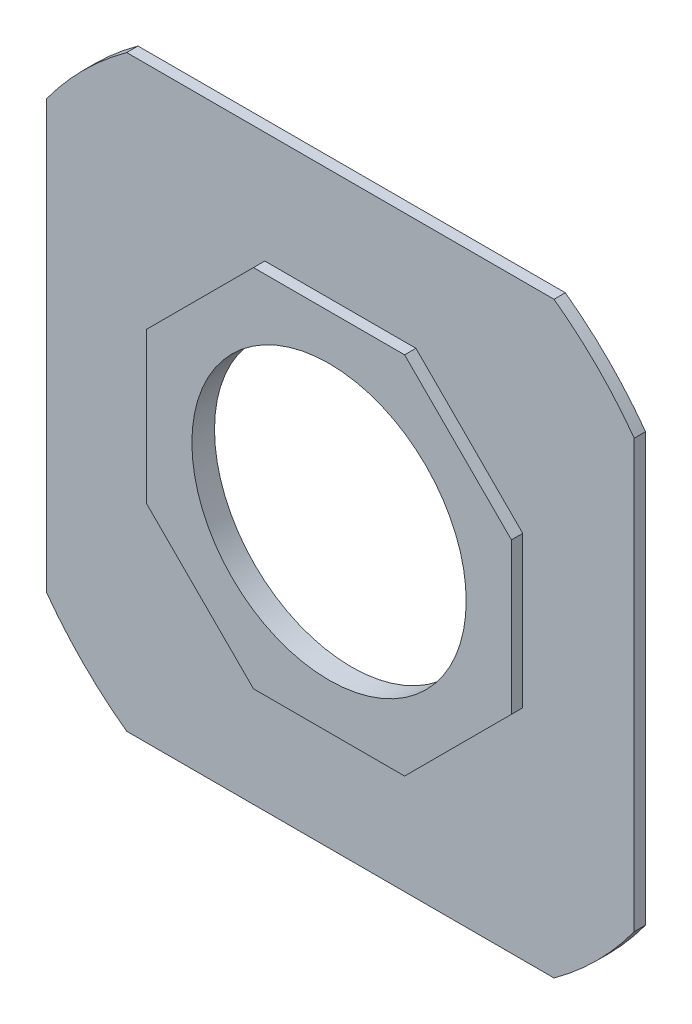
ISO-10303-21;
HEADER;
FILE_DESCRIPTION(('STEP AP214'),'2;1');
FILE_NAME('part.step','',(''),(''),'','','');
FILE_SCHEMA(('AUTOMOTIVE_DESIGN { 1 0 10303 214 1 1 1 1 }'));
ENDSEC;
DATA;
#1=APPLICATION_CONTEXT('core data for automotive mechanical design processes');
#2=APPLICATION_PROTOCOL_DEFINITION('international standard','automotive_design',2000,#1);
#3=PRODUCT_CONTEXT('',#1,'mechanical');
#4=PRODUCT('Part','Part','',(#3));
#5=PRODUCT_RELATED_PRODUCT_CATEGORY('part','',(#4));
#6=PRODUCT_DEFINITION_FORMATION('','',#4);
#7=PRODUCT_DEFINITION_CONTEXT('part definition',#1,'design');
#8=PRODUCT_DEFINITION('design','',#6,#7);
#9=PRODUCT_DEFINITION_SHAPE('','',#8);
#10=(LENGTH_UNIT() NAMED_UNIT(*) SI_UNIT(.MILLI.,.METRE.));
#11=(NAMED_UNIT(*) PLANE_ANGLE_UNIT() SI_UNIT($,.RADIAN.));
#12=(NAMED_UNIT(*) SI_UNIT($,.STERADIAN.) SOLID_ANGLE_UNIT());
#13=UNCERTAINTY_MEASURE_WITH_UNIT(LENGTH_MEASURE(1.E-05),#10,'distance_accuracy_value','');
#14=(GEOMETRIC_REPRESENTATION_CONTEXT(3) GLOBAL_UNCERTAINTY_ASSIGNED_CONTEXT((#13)) GLOBAL_UNIT_ASSIGNED_CONTEXT((#10,
#11,#12)) REPRESENTATION_CONTEXT('',''));
#15=CARTESIAN_POINT('',(0.,0.,0.));
#16=DIRECTION('',(0.,0.,1.));
#17=DIRECTION('',(1.,0.,0.));
#18=AXIS2_PLACEMENT_3D('',#15,#16,#17);
#19=CARTESIAN_POINT('',(0.,0.,3.175));
#20=DIRECTION('',(0.,0.,1.));
#21=DIRECTION('',(1.,0.,0.));
#22=AXIS2_PLACEMENT_3D('',#19,#20,#21);
#23=PLANE('',#22);
#24=DIRECTION('',(0.707106781186548,-0.707106781186547,0.));
#25=VECTOR('',#24,1.);
#26=CARTESIAN_POINT('',(36.2038671967512,36.2038671967513,3.175));
#27=LINE('',#26,#25);
#28=CARTESIAN_POINT('',(21.2077343935025,51.2,3.175));
#29=VERTEX_POINT('',#28);
#30=CARTESIAN_POINT('',(51.2,21.2077343935025,3.175));
#31=VERTEX_POINT('',#30);
#32=EDGE_CURVE('E282',#29,#31,#27,.T.);
#33=ORIENTED_EDGE('',*,*,#32,.T.);
#34=DIRECTION('',(0.,-1.,0.));
#35=VECTOR('',#34,1.);
#36=CARTESIAN_POINT('',(51.2,0.,3.175));
#37=LINE('',#36,#35);
#38=CARTESIAN_POINT('',(51.2,-21.2077343935025,3.175));
#39=VERTEX_POINT('',#38);
#40=EDGE_CURVE('E49',#31,#39,#37,.T.);
#41=ORIENTED_EDGE('',*,*,#40,.T.);
#42=DIRECTION('',(-0.707106781186547,-0.707106781186548,0.));
#43=VECTOR('',#42,1.);
#44=CARTESIAN_POINT('',(36.2038671967513,-36.2038671967512,3.175));
#45=LINE('',#44,#43);
#46=CARTESIAN_POINT('',(21.2077343935025,-51.2,3.175));
#47=VERTEX_POINT('',#46);
#48=EDGE_CURVE('E264',#39,#47,#45,.T.);
#49=ORIENTED_EDGE('',*,*,#48,.T.);
#50=DIRECTION('',(-1.,0.,0.));
#51=VECTOR('',#50,1.);
#52=CARTESIAN_POINT('',(0.,-51.2,3.175));
#53=LINE('',#52,#51);
#54=CARTESIAN_POINT('',(-21.2077343935024,-51.2,3.175));
#55=VERTEX_POINT('',#54);
#56=EDGE_CURVE('E267',#47,#55,#53,.T.);
#57=ORIENTED_EDGE('',*,*,#56,.T.);
#58=DIRECTION('',(-0.707106781186548,0.707106781186547,0.));
#59=VECTOR('',#58,1.);
#60=CARTESIAN_POINT('',(-36.2038671967512,-36.2038671967512,3.175));
#61=LINE('',#60,#59);
#62=CARTESIAN_POINT('',(-51.2,-21.2077343935025,3.175));
#63=VERTEX_POINT('',#62);
#64=EDGE_CURVE('E270',#55,#63,#61,.T.);
#65=ORIENTED_EDGE('',*,*,#64,.T.);
#66=DIRECTION('',(0.,1.,0.));
#67=VECTOR('',#66,1.);
#68=CARTESIAN_POINT('',(-51.2,0.,3.175));
#69=LINE('',#68,#67);
#70=CARTESIAN_POINT('',(-51.2,21.2077343935025,3.175));
#71=VERTEX_POINT('',#70);
#72=EDGE_CURVE('E273',#63,#71,#69,.T.);
#73=ORIENTED_EDGE('',*,*,#72,.T.);
#74=DIRECTION('',(0.707106781186547,0.707106781186548,0.));
#75=VECTOR('',#74,1.);
#76=CARTESIAN_POINT('',(-36.2038671967513,36.2038671967512,3.175));
#77=LINE('',#76,#75);
#78=CARTESIAN_POINT('',(-21.2077343935025,51.2,3.175));
#79=VERTEX_POINT('',#78);
#80=EDGE_CURVE('E276',#71,#79,#77,.T.);
#81=ORIENTED_EDGE('',*,*,#80,.T.);
#82=DIRECTION('',(1.,0.,0.));
#83=VECTOR('',#82,1.);
#84=CARTESIAN_POINT('',(0.,51.2,3.175));
#85=LINE('',#84,#83);
#86=EDGE_CURVE('E279',#79,#29,#85,.T.);
#87=ORIENTED_EDGE('',*,*,#86,.T.);
#88=EDGE_LOOP('',(#33,#41,#49,#57,#65,#73,#81,#87));
#89=FACE_BOUND('',#88,.T.);
#90=DIRECTION('',(0.,1.,0.));
#91=VECTOR('',#90,1.);
#92=CARTESIAN_POINT('',(82.5,0.,3.175));
#93=LINE('',#92,#91);
#94=CARTESIAN_POINT('',(82.5,-59.9812470693966,3.175));
#95=VERTEX_POINT('',#94);
#96=CARTESIAN_POINT('',(82.5,59.9812470693966,3.175));
#97=VERTEX_POINT('',#96);
#98=EDGE_CURVE('E215',#95,#97,#93,.T.);
#99=ORIENTED_EDGE('',*,*,#98,.T.);
#100=CARTESIAN_POINT('',(0.,0.,3.175));
#101=DIRECTION('',(0.,0.,1.));
#102=DIRECTION('',(1.,0.,0.));
#103=AXIS2_PLACEMENT_3D('',#100,#101,#102);
#104=CIRCLE('',#103,102.);
#105=CARTESIAN_POINT('',(59.9812470693966,82.5,3.175));
#106=VERTEX_POINT('',#105);
#107=EDGE_CURVE('E218',#97,#106,#104,.T.);
#108=ORIENTED_EDGE('',*,*,#107,.T.);
#109=DIRECTION('',(1.,0.,0.));
#110=VECTOR('',#109,1.);
#111=CARTESIAN_POINT('',(0.,82.5,3.175));
#112=LINE('',#111,#110);
#113=CARTESIAN_POINT('',(-59.9812470693966,82.5,3.175));
#114=VERTEX_POINT('',#113);
#115=EDGE_CURVE('E191',#114,#106,#112,.T.);
#116=ORIENTED_EDGE('',*,*,#115,.F.);
#117=CARTESIAN_POINT('',(0.,0.,3.175));
#118=DIRECTION('',(0.,0.,1.));
#119=DIRECTION('',(1.,0.,0.));
#120=AXIS2_PLACEMENT_3D('',#117,#118,#119);
#121=CIRCLE('',#120,102.);
#122=CARTESIAN_POINT('',(-82.5,59.9812470693966,3.175));
#123=VERTEX_POINT('',#122);
#124=EDGE_CURVE('E160',#114,#123,#121,.T.);
#125=ORIENTED_EDGE('',*,*,#124,.T.);
#126=DIRECTION('',(0.,1.,0.));
#127=VECTOR('',#126,1.);
#128=CARTESIAN_POINT('',(-82.5,0.,3.175));
#129=LINE('',#128,#127);
#130=CARTESIAN_POINT('',(-82.5,-59.9812470693966,3.175));
#131=VERTEX_POINT('',#130);
#132=EDGE_CURVE('E204',#131,#123,#129,.T.);
#133=ORIENTED_EDGE('',*,*,#132,.F.);
#134=CARTESIAN_POINT('',(0.,0.,3.175));
#135=DIRECTION('',(0.,0.,1.));
#136=DIRECTION('',(1.,0.,0.));
#137=AXIS2_PLACEMENT_3D('',#134,#135,#136);
#138=CIRCLE('',#137,102.);
#139=CARTESIAN_POINT('',(-59.9812470693966,-82.5,3.175));
#140=VERTEX_POINT('',#139);
#141=EDGE_CURVE('E206',#131,#140,#138,.T.);
#142=ORIENTED_EDGE('',*,*,#141,.T.);
#143=DIRECTION('',(1.,0.,0.));
#144=VECTOR('',#143,1.);
#145=CARTESIAN_POINT('',(0.,-82.5,3.175));
#146=LINE('',#145,#144);
#147=CARTESIAN_POINT('',(59.9812470693966,-82.5,3.175));
#148=VERTEX_POINT('',#147);
#149=EDGE_CURVE('E209',#140,#148,#146,.T.);
#150=ORIENTED_EDGE('',*,*,#149,.T.);
#151=CARTESIAN_POINT('',(0.,0.,3.175));
#152=DIRECTION('',(0.,0.,1.));
#153=DIRECTION('',(1.,0.,0.));
#154=AXIS2_PLACEMENT_3D('',#151,#152,#153);
#155=CIRCLE('',#154,102.);
#156=EDGE_CURVE('E212',#148,#95,#155,.T.);
#157=ORIENTED_EDGE('',*,*,#156,.T.);
#158=EDGE_LOOP('',(#99,#108,#116,#125,#133,#142,#150,#157));
#159=FACE_BOUND('',#158,.T.);
#160=ADVANCED_FACE('F41',(#89,#159),#23,.T.);
#161=CARTESIAN_POINT('',(0.,0.,0.));
#162=DIRECTION('',(0.,0.,1.));
#163=DIRECTION('',(1.,0.,0.));
#164=AXIS2_PLACEMENT_3D('',#161,#162,#163);
#165=PLANE('',#164);
#166=CARTESIAN_POINT('',(0.,0.,0.));
#167=DIRECTION('',(0.,0.,1.));
#168=DIRECTION('',(1.,0.,0.));
#169=AXIS2_PLACEMENT_3D('',#166,#167,#168);
#170=CIRCLE('',#169,38.5);
#171=CARTESIAN_POINT('',(38.5,0.,0.));
#172=VERTEX_POINT('',#171);
#173=EDGE_CURVE('E11',#172,#172,#170,.T.);
#174=ORIENTED_EDGE('',*,*,#173,.T.);
#175=EDGE_LOOP('',(#174));
#176=FACE_BOUND('',#175,.T.);
#177=CARTESIAN_POINT('',(0.,0.,0.));
#178=DIRECTION('',(0.,0.,-1.));
#179=DIRECTION('',(-1.,0.,0.));
#180=AXIS2_PLACEMENT_3D('',#177,#178,#179);
#181=CIRCLE('',#180,102.);
#182=CARTESIAN_POINT('',(59.9812470693966,82.5,0.));
#183=VERTEX_POINT('',#182);
#184=CARTESIAN_POINT('',(82.5,59.9812470693966,0.));
#185=VERTEX_POINT('',#184);
#186=EDGE_CURVE('E64',#183,#185,#181,.T.);
#187=ORIENTED_EDGE('',*,*,#186,.T.);
#188=DIRECTION('',(0.,-1.,0.));
#189=VECTOR('',#188,1.);
#190=CARTESIAN_POINT('',(82.5,0.,0.));
#191=LINE('',#190,#189);
#192=CARTESIAN_POINT('',(82.5,-59.9812470693966,0.));
#193=VERTEX_POINT('',#192);
#194=EDGE_CURVE('E186',#185,#193,#191,.T.);
#195=ORIENTED_EDGE('',*,*,#194,.T.);
#196=CARTESIAN_POINT('',(0.,0.,0.));
#197=DIRECTION('',(0.,0.,-1.));
#198=DIRECTION('',(-1.,0.,0.));
#199=AXIS2_PLACEMENT_3D('',#196,#197,#198);
#200=CIRCLE('',#199,102.);
#201=CARTESIAN_POINT('',(59.9812470693966,-82.5,0.));
#202=VERTEX_POINT('',#201);
#203=EDGE_CURVE('E183',#193,#202,#200,.T.);
#204=ORIENTED_EDGE('',*,*,#203,.T.);
#205=DIRECTION('',(-1.,0.,0.));
#206=VECTOR('',#205,1.);
#207=CARTESIAN_POINT('',(0.,-82.5,0.));
#208=LINE('',#207,#206);
#209=CARTESIAN_POINT('',(-59.9812470693966,-82.5,0.));
#210=VERTEX_POINT('',#209);
#211=EDGE_CURVE('E180',#202,#210,#208,.T.);
#212=ORIENTED_EDGE('',*,*,#211,.T.);
#213=CARTESIAN_POINT('',(0.,0.,0.));
#214=DIRECTION('',(0.,0.,-1.));
#215=DIRECTION('',(-1.,0.,0.));
#216=AXIS2_PLACEMENT_3D('',#213,#214,#215);
#217=CIRCLE('',#216,102.);
#218=CARTESIAN_POINT('',(-82.5,-59.9812470693966,0.));
#219=VERTEX_POINT('',#218);
#220=EDGE_CURVE('E175',#210,#219,#217,.T.);
#221=ORIENTED_EDGE('',*,*,#220,.T.);
#222=DIRECTION('',(0.,-1.,0.));
#223=VECTOR('',#222,1.);
#224=CARTESIAN_POINT('',(-82.5,0.,0.));
#225=LINE('',#224,#223);
#226=CARTESIAN_POINT('',(-82.5,59.9812470693966,0.));
#227=VERTEX_POINT('',#226);
#228=EDGE_CURVE('E173',#227,#219,#225,.T.);
#229=ORIENTED_EDGE('',*,*,#228,.F.);
#230=CARTESIAN_POINT('',(0.,0.,0.));
#231=DIRECTION('',(0.,0.,-1.));
#232=DIRECTION('',(-1.,0.,0.));
#233=AXIS2_PLACEMENT_3D('',#230,#231,#232);
#234=CIRCLE('',#233,102.);
#235=CARTESIAN_POINT('',(-59.9812470693966,82.5,0.));
#236=VERTEX_POINT('',#235);
#237=EDGE_CURVE('E157',#227,#236,#234,.T.);
#238=ORIENTED_EDGE('',*,*,#237,.T.);
#239=DIRECTION('',(-1.,0.,0.));
#240=VECTOR('',#239,1.);
#241=CARTESIAN_POINT('',(0.,82.5,0.));
#242=LINE('',#241,#240);
#243=EDGE_CURVE('E166',#183,#236,#242,.T.);
#244=ORIENTED_EDGE('',*,*,#243,.F.);
#245=EDGE_LOOP('',(#187,#195,#204,#212,#221,#229,#238,#244));
#246=FACE_BOUND('',#245,.T.);
#247=ADVANCED_FACE('F170',(#176,#246),#165,.F.);
#248=CARTESIAN_POINT('',(0.,0.,3.175));
#249=DIRECTION('',(0.,0.,-1.));
#250=DIRECTION('',(-1.,0.,0.));
#251=AXIS2_PLACEMENT_3D('',#248,#249,#250);
#252=CYLINDRICAL_SURFACE('',#251,38.5);
#253=ORIENTED_EDGE('',*,*,#173,.F.);
#254=EDGE_LOOP('',(#253));
#255=FACE_BOUND('',#254,.T.);
#256=CARTESIAN_POINT('',(0.,0.,6.35));
#257=DIRECTION('',(0.,0.,1.));
#258=DIRECTION('',(1.,0.,0.));
#259=AXIS2_PLACEMENT_3D('',#256,#257,#258);
#260=CIRCLE('',#259,38.5);
#261=CARTESIAN_POINT('',(38.5,0.,6.35));
#262=VERTEX_POINT('',#261);
#263=EDGE_CURVE('E221',#262,#262,#260,.T.);
#264=ORIENTED_EDGE('',*,*,#263,.T.);
#265=EDGE_LOOP('',(#264));
#266=FACE_BOUND('',#265,.T.);
#267=ADVANCED_FACE('F43',(#255,#266),#252,.F.);
#268=CARTESIAN_POINT('',(51.2,0.,6.35));
#269=DIRECTION('',(-1.,0.,0.));
#270=DIRECTION('',(0.,0.,1.));
#271=AXIS2_PLACEMENT_3D('',#268,#269,#270);
#272=PLANE('',#271);
#273=ORIENTED_EDGE('',*,*,#40,.F.);
#274=DIRECTION('',(0.,0.,-1.));
#275=VECTOR('',#274,1.);
#276=CARTESIAN_POINT('',(51.2,21.2077343935025,6.35));
#277=LINE('',#276,#275);
#278=CARTESIAN_POINT('',(51.2,21.2077343935025,6.35));
#279=VERTEX_POINT('',#278);
#280=EDGE_CURVE('E261',#279,#31,#277,.T.);
#281=ORIENTED_EDGE('',*,*,#280,.F.);
#282=DIRECTION('',(0.,1.,0.));
#283=VECTOR('',#282,1.);
#284=CARTESIAN_POINT('',(51.2,0.,6.35));
#285=LINE('',#284,#283);
#286=CARTESIAN_POINT('',(51.2,-21.2077343935025,6.35));
#287=VERTEX_POINT('',#286);
#288=EDGE_CURVE('E224',#287,#279,#285,.T.);
#289=ORIENTED_EDGE('',*,*,#288,.F.);
#290=DIRECTION('',(0.,0.,-1.));
#291=VECTOR('',#290,1.);
#292=CARTESIAN_POINT('',(51.2,-21.2077343935025,6.35));
#293=LINE('',#292,#291);
#294=EDGE_CURVE('E241',#287,#39,#293,.T.);
#295=ORIENTED_EDGE('',*,*,#294,.T.);
#296=EDGE_LOOP('',(#273,#281,#289,#295));
#297=FACE_BOUND('',#296,.T.);
#298=ADVANCED_FACE('F289',(#297),#272,.F.);
#299=CARTESIAN_POINT('',(36.2038671967513,36.2038671967513,6.35));
#300=DIRECTION('',(-0.707106781186547,-0.707106781186548,0.));
#301=DIRECTION('',(0.707106781186548,-0.707106781186547,0.));
#302=AXIS2_PLACEMENT_3D('',#299,#300,#301);
#303=PLANE('',#302);
#304=ORIENTED_EDGE('',*,*,#32,.F.);
#305=DIRECTION('',(0.,0.,-1.));
#306=VECTOR('',#305,1.);
#307=CARTESIAN_POINT('',(21.2077343935025,51.2,6.35));
#308=LINE('',#307,#306);
#309=CARTESIAN_POINT('',(21.2077343935025,51.2,6.35));
#310=VERTEX_POINT('',#309);
#311=EDGE_CURVE('E258',#310,#29,#308,.T.);
#312=ORIENTED_EDGE('',*,*,#311,.F.);
#313=DIRECTION('',(-0.707106781186548,0.707106781186547,0.));
#314=VECTOR('',#313,1.);
#315=CARTESIAN_POINT('',(36.2038671967513,36.2038671967513,6.35));
#316=LINE('',#315,#314);
#317=EDGE_CURVE('E227',#279,#310,#316,.T.);
#318=ORIENTED_EDGE('',*,*,#317,.F.);
#319=ORIENTED_EDGE('',*,*,#280,.T.);
#320=EDGE_LOOP('',(#304,#312,#318,#319));
#321=FACE_BOUND('',#320,.T.);
#322=ADVANCED_FACE('F293',(#321),#303,.F.);
#323=CARTESIAN_POINT('',(0.,51.2,6.35));
#324=DIRECTION('',(0.,-1.,0.));
#325=DIRECTION('',(1.,0.,0.));
#326=AXIS2_PLACEMENT_3D('',#323,#324,#325);
#327=PLANE('',#326);
#328=ORIENTED_EDGE('',*,*,#86,.F.);
#329=DIRECTION('',(0.,0.,-1.));
#330=VECTOR('',#329,1.);
#331=CARTESIAN_POINT('',(-21.2077343935025,51.2,6.35));
#332=LINE('',#331,#330);
#333=CARTESIAN_POINT('',(-21.2077343935025,51.2,6.35));
#334=VERTEX_POINT('',#333);
#335=EDGE_CURVE('E255',#334,#79,#332,.T.);
#336=ORIENTED_EDGE('',*,*,#335,.F.);
#337=DIRECTION('',(-1.,0.,0.));
#338=VECTOR('',#337,1.);
#339=CARTESIAN_POINT('',(0.,51.2,6.35));
#340=LINE('',#339,#338);
#341=EDGE_CURVE('E229',#310,#334,#340,.T.);
#342=ORIENTED_EDGE('',*,*,#341,.F.);
#343=ORIENTED_EDGE('',*,*,#311,.T.);
#344=EDGE_LOOP('',(#328,#336,#342,#343));
#345=FACE_BOUND('',#344,.T.);
#346=ADVANCED_FACE('F320',(#345),#327,.F.);
#347=CARTESIAN_POINT('',(-36.2038671967512,36.2038671967512,6.35));
#348=DIRECTION('',(0.707106781186548,-0.707106781186547,0.));
#349=DIRECTION('',(0.707106781186547,0.707106781186548,0.));
#350=AXIS2_PLACEMENT_3D('',#347,#348,#349);
#351=PLANE('',#350);
#352=ORIENTED_EDGE('',*,*,#80,.F.);
#353=DIRECTION('',(0.,0.,-1.));
#354=VECTOR('',#353,1.);
#355=CARTESIAN_POINT('',(-51.2,21.2077343935025,6.35));
#356=LINE('',#355,#354);
#357=CARTESIAN_POINT('',(-51.2,21.2077343935025,6.35));
#358=VERTEX_POINT('',#357);
#359=EDGE_CURVE('E252',#358,#71,#356,.T.);
#360=ORIENTED_EDGE('',*,*,#359,.F.);
#361=DIRECTION('',(-0.707106781186547,-0.707106781186548,0.));
#362=VECTOR('',#361,1.);
#363=CARTESIAN_POINT('',(-36.2038671967512,36.2038671967512,6.35));
#364=LINE('',#363,#362);
#365=EDGE_CURVE('E231',#334,#358,#364,.T.);
#366=ORIENTED_EDGE('',*,*,#365,.F.);
#367=ORIENTED_EDGE('',*,*,#335,.T.);
#368=EDGE_LOOP('',(#352,#360,#366,#367));
#369=FACE_BOUND('',#368,.T.);
#370=ADVANCED_FACE('F317',(#369),#351,.F.);
#371=CARTESIAN_POINT('',(-51.2,0.,6.35));
#372=DIRECTION('',(1.,0.,0.));
#373=DIRECTION('',(0.,1.,0.));
#374=AXIS2_PLACEMENT_3D('',#371,#372,#373);
#375=PLANE('',#374);
#376=ORIENTED_EDGE('',*,*,#72,.F.);
#377=DIRECTION('',(0.,0.,-1.));
#378=VECTOR('',#377,1.);
#379=CARTESIAN_POINT('',(-51.2,-21.2077343935025,6.35));
#380=LINE('',#379,#378);
#381=CARTESIAN_POINT('',(-51.2,-21.2077343935025,6.35));
#382=VERTEX_POINT('',#381);
#383=EDGE_CURVE('E249',#382,#63,#380,.T.);
#384=ORIENTED_EDGE('',*,*,#383,.F.);
#385=DIRECTION('',(0.,-1.,0.));
#386=VECTOR('',#385,1.);
#387=CARTESIAN_POINT('',(-51.2,0.,6.35));
#388=LINE('',#387,#386);
#389=EDGE_CURVE('E233',#358,#382,#388,.T.);
#390=ORIENTED_EDGE('',*,*,#389,.F.);
#391=ORIENTED_EDGE('',*,*,#359,.T.);
#392=EDGE_LOOP('',(#376,#384,#390,#391));
#393=FACE_BOUND('',#392,.T.);
#394=ADVANCED_FACE('F313',(#393),#375,.F.);
#395=CARTESIAN_POINT('',(-36.2038671967512,-36.2038671967512,6.35));
#396=DIRECTION('',(0.707106781186547,0.707106781186548,0.));
#397=DIRECTION('',(-0.707106781186548,0.707106781186547,0.));
#398=AXIS2_PLACEMENT_3D('',#395,#396,#397);
#399=PLANE('',#398);
#400=ORIENTED_EDGE('',*,*,#64,.F.);
#401=DIRECTION('',(0.,0.,-1.));
#402=VECTOR('',#401,1.);
#403=CARTESIAN_POINT('',(-21.2077343935024,-51.2,6.35));
#404=LINE('',#403,#402);
#405=CARTESIAN_POINT('',(-21.2077343935024,-51.2,6.35));
#406=VERTEX_POINT('',#405);
#407=EDGE_CURVE('E246',#406,#55,#404,.T.);
#408=ORIENTED_EDGE('',*,*,#407,.F.);
#409=DIRECTION('',(0.707106781186548,-0.707106781186547,0.));
#410=VECTOR('',#409,1.);
#411=CARTESIAN_POINT('',(-36.2038671967512,-36.2038671967512,6.35));
#412=LINE('',#411,#410);
#413=EDGE_CURVE('E235',#382,#406,#412,.T.);
#414=ORIENTED_EDGE('',*,*,#413,.F.);
#415=ORIENTED_EDGE('',*,*,#383,.T.);
#416=EDGE_LOOP('',(#400,#408,#414,#415));
#417=FACE_BOUND('',#416,.T.);
#418=ADVANCED_FACE('F308',(#417),#399,.F.);
#419=CARTESIAN_POINT('',(0.,-51.2,6.35));
#420=DIRECTION('',(0.,1.,0.));
#421=DIRECTION('',(-1.,0.,0.));
#422=AXIS2_PLACEMENT_3D('',#419,#420,#421);
#423=PLANE('',#422);
#424=ORIENTED_EDGE('',*,*,#56,.F.);
#425=DIRECTION('',(0.,0.,-1.));
#426=VECTOR('',#425,1.);
#427=CARTESIAN_POINT('',(21.2077343935025,-51.2,6.35));
#428=LINE('',#427,#426);
#429=CARTESIAN_POINT('',(21.2077343935025,-51.2,6.35));
#430=VERTEX_POINT('',#429);
#431=EDGE_CURVE('E244',#430,#47,#428,.T.);
#432=ORIENTED_EDGE('',*,*,#431,.F.);
#433=DIRECTION('',(1.,0.,0.));
#434=VECTOR('',#433,1.);
#435=CARTESIAN_POINT('',(0.,-51.2,6.35));
#436=LINE('',#435,#434);
#437=EDGE_CURVE('E237',#406,#430,#436,.T.);
#438=ORIENTED_EDGE('',*,*,#437,.F.);
#439=ORIENTED_EDGE('',*,*,#407,.T.);
#440=EDGE_LOOP('',(#424,#432,#438,#439));
#441=FACE_BOUND('',#440,.T.);
#442=ADVANCED_FACE('F305',(#441),#423,.F.);
#443=CARTESIAN_POINT('',(36.2038671967513,-36.2038671967513,6.35));
#444=DIRECTION('',(-0.707106781186548,0.707106781186547,0.));
#445=DIRECTION('',(-0.707106781186547,-0.707106781186548,0.));
#446=AXIS2_PLACEMENT_3D('',#443,#444,#445);
#447=PLANE('',#446);
#448=ORIENTED_EDGE('',*,*,#48,.F.);
#449=ORIENTED_EDGE('',*,*,#294,.F.);
#450=DIRECTION('',(0.707106781186547,0.707106781186548,0.));
#451=VECTOR('',#450,1.);
#452=CARTESIAN_POINT('',(36.2038671967513,-36.2038671967513,6.35));
#453=LINE('',#452,#451);
#454=EDGE_CURVE('E239',#430,#287,#453,.T.);
#455=ORIENTED_EDGE('',*,*,#454,.F.);
#456=ORIENTED_EDGE('',*,*,#431,.T.);
#457=EDGE_LOOP('',(#448,#449,#455,#456));
#458=FACE_BOUND('',#457,.T.);
#459=ADVANCED_FACE('F302',(#458),#447,.F.);
#460=CARTESIAN_POINT('',(0.,0.,6.35));
#461=DIRECTION('',(0.,0.,1.));
#462=DIRECTION('',(1.,0.,0.));
#463=AXIS2_PLACEMENT_3D('',#460,#461,#462);
#464=PLANE('',#463);
#465=ORIENTED_EDGE('',*,*,#263,.F.);
#466=EDGE_LOOP('',(#465));
#467=FACE_BOUND('',#466,.T.);
#468=ORIENTED_EDGE('',*,*,#288,.T.);
#469=ORIENTED_EDGE('',*,*,#317,.T.);
#470=ORIENTED_EDGE('',*,*,#341,.T.);
#471=ORIENTED_EDGE('',*,*,#365,.T.);
#472=ORIENTED_EDGE('',*,*,#389,.T.);
#473=ORIENTED_EDGE('',*,*,#413,.T.);
#474=ORIENTED_EDGE('',*,*,#437,.T.);
#475=ORIENTED_EDGE('',*,*,#454,.T.);
#476=EDGE_LOOP('',(#468,#469,#470,#471,#472,#473,#474,#475));
#477=FACE_BOUND('',#476,.T.);
#478=ADVANCED_FACE('F297',(#467,#477),#464,.T.);
#479=CARTESIAN_POINT('',(0.,0.,15.));
#480=DIRECTION('',(0.,0.,-1.));
#481=DIRECTION('',(-1.,0.,0.));
#482=AXIS2_PLACEMENT_3D('',#479,#480,#481);
#483=CYLINDRICAL_SURFACE('',#482,102.);
#484=DIRECTION('',(0.,0.,-1.));
#485=VECTOR('',#484,1.);
#486=CARTESIAN_POINT('',(82.5,59.9812470693966,15.));
#487=LINE('',#486,#485);
#488=EDGE_CURVE('E189',#97,#185,#487,.T.);
#489=ORIENTED_EDGE('',*,*,#488,.T.);
#490=ORIENTED_EDGE('',*,*,#186,.F.);
#491=DIRECTION('',(0.,0.,-1.));
#492=VECTOR('',#491,1.);
#493=CARTESIAN_POINT('',(59.9812470693966,82.5,15.));
#494=LINE('',#493,#492);
#495=EDGE_CURVE('E163',#106,#183,#494,.T.);
#496=ORIENTED_EDGE('',*,*,#495,.F.);
#497=ORIENTED_EDGE('',*,*,#107,.F.);
#498=EDGE_LOOP('',(#489,#490,#496,#497));
#499=FACE_BOUND('',#498,.T.);
#500=ADVANCED_FACE('F349',(#499),#483,.T.);
#501=CARTESIAN_POINT('',(82.5,0.,15.));
#502=DIRECTION('',(1.,0.,0.));
#503=DIRECTION('',(0.,0.,-1.));
#504=AXIS2_PLACEMENT_3D('',#501,#502,#503);
#505=PLANE('',#504);
#506=DIRECTION('',(0.,0.,-1.));
#507=VECTOR('',#506,1.);
#508=CARTESIAN_POINT('',(82.5,-59.9812470693966,15.));
#509=LINE('',#508,#507);
#510=EDGE_CURVE('E192',#95,#193,#509,.T.);
#511=ORIENTED_EDGE('',*,*,#510,.T.);
#512=ORIENTED_EDGE('',*,*,#194,.F.);
#513=ORIENTED_EDGE('',*,*,#488,.F.);
#514=ORIENTED_EDGE('',*,*,#98,.F.);
#515=EDGE_LOOP('',(#511,#512,#513,#514));
#516=FACE_BOUND('',#515,.T.);
#517=ADVANCED_FACE('F354',(#516),#505,.T.);
#518=CARTESIAN_POINT('',(0.,0.,15.));
#519=DIRECTION('',(0.,0.,-1.));
#520=DIRECTION('',(-1.,0.,0.));
#521=AXIS2_PLACEMENT_3D('',#518,#519,#520);
#522=CYLINDRICAL_SURFACE('',#521,102.);
#523=DIRECTION('',(0.,0.,-1.));
#524=VECTOR('',#523,1.);
#525=CARTESIAN_POINT('',(59.9812470693966,-82.5,15.));
#526=LINE('',#525,#524);
#527=EDGE_CURVE('E194',#148,#202,#526,.T.);
#528=ORIENTED_EDGE('',*,*,#527,.T.);
#529=ORIENTED_EDGE('',*,*,#203,.F.);
#530=ORIENTED_EDGE('',*,*,#510,.F.);
#531=ORIENTED_EDGE('',*,*,#156,.F.);
#532=EDGE_LOOP('',(#528,#529,#530,#531));
#533=FACE_BOUND('',#532,.T.);
#534=ADVANCED_FACE('F415',(#533),#522,.T.);
#535=CARTESIAN_POINT('',(0.,-82.5,15.));
#536=DIRECTION('',(0.,-1.,0.));
#537=DIRECTION('',(0.,0.,-1.));
#538=AXIS2_PLACEMENT_3D('',#535,#536,#537);
#539=PLANE('',#538);
#540=DIRECTION('',(0.,0.,-1.));
#541=VECTOR('',#540,1.);
#542=CARTESIAN_POINT('',(-59.9812470693966,-82.5,15.));
#543=LINE('',#542,#541);
#544=EDGE_CURVE('E196',#140,#210,#543,.T.);
#545=ORIENTED_EDGE('',*,*,#544,.T.);
#546=ORIENTED_EDGE('',*,*,#211,.F.);
#547=ORIENTED_EDGE('',*,*,#527,.F.);
#548=ORIENTED_EDGE('',*,*,#149,.F.);
#549=EDGE_LOOP('',(#545,#546,#547,#548));
#550=FACE_BOUND('',#549,.T.);
#551=ADVANCED_FACE('F424',(#550),#539,.T.);
#552=CARTESIAN_POINT('',(0.,0.,15.));
#553=DIRECTION('',(0.,0.,-1.));
#554=DIRECTION('',(-1.,0.,0.));
#555=AXIS2_PLACEMENT_3D('',#552,#553,#554);
#556=CYLINDRICAL_SURFACE('',#555,102.);
#557=DIRECTION('',(0.,0.,-1.));
#558=VECTOR('',#557,1.);
#559=CARTESIAN_POINT('',(-82.5,-59.9812470693966,15.));
#560=LINE('',#559,#558);
#561=EDGE_CURVE('E198',#131,#219,#560,.T.);
#562=ORIENTED_EDGE('',*,*,#561,.T.);
#563=ORIENTED_EDGE('',*,*,#220,.F.);
#564=ORIENTED_EDGE('',*,*,#544,.F.);
#565=ORIENTED_EDGE('',*,*,#141,.F.);
#566=EDGE_LOOP('',(#562,#563,#564,#565));
#567=FACE_BOUND('',#566,.T.);
#568=ADVANCED_FACE('F433',(#567),#556,.T.);
#569=CARTESIAN_POINT('',(-82.5,0.,15.));
#570=DIRECTION('',(1.,0.,0.));
#571=DIRECTION('',(0.,0.,-1.));
#572=AXIS2_PLACEMENT_3D('',#569,#570,#571);
#573=PLANE('',#572);
#574=ORIENTED_EDGE('',*,*,#132,.T.);
#575=DIRECTION('',(0.,0.,-1.));
#576=VECTOR('',#575,1.);
#577=CARTESIAN_POINT('',(-82.5,59.9812470693966,15.));
#578=LINE('',#577,#576);
#579=EDGE_CURVE('E162',#123,#227,#578,.T.);
#580=ORIENTED_EDGE('',*,*,#579,.T.);
#581=ORIENTED_EDGE('',*,*,#228,.T.);
#582=ORIENTED_EDGE('',*,*,#561,.F.);
#583=EDGE_LOOP('',(#574,#580,#581,#582));
#584=FACE_BOUND('',#583,.T.);
#585=ADVANCED_FACE('F442',(#584),#573,.F.);
#586=CARTESIAN_POINT('',(0.,0.,15.));
#587=DIRECTION('',(0.,0.,-1.));
#588=DIRECTION('',(-1.,0.,0.));
#589=AXIS2_PLACEMENT_3D('',#586,#587,#588);
#590=CYLINDRICAL_SURFACE('',#589,102.);
#591=DIRECTION('',(0.,0.,-1.));
#592=VECTOR('',#591,1.);
#593=CARTESIAN_POINT('',(-59.9812470693966,82.5,15.));
#594=LINE('',#593,#592);
#595=EDGE_CURVE('E56',#114,#236,#594,.T.);
#596=ORIENTED_EDGE('',*,*,#595,.T.);
#597=ORIENTED_EDGE('',*,*,#237,.F.);
#598=ORIENTED_EDGE('',*,*,#579,.F.);
#599=ORIENTED_EDGE('',*,*,#124,.F.);
#600=EDGE_LOOP('',(#596,#597,#598,#599));
#601=FACE_BOUND('',#600,.T.);
#602=ADVANCED_FACE('F154',(#601),#590,.T.);
#603=CARTESIAN_POINT('',(0.,82.5,15.));
#604=DIRECTION('',(0.,-1.,0.));
#605=DIRECTION('',(0.,0.,-1.));
#606=AXIS2_PLACEMENT_3D('',#603,#604,#605);
#607=PLANE('',#606);
#608=ORIENTED_EDGE('',*,*,#115,.T.);
#609=ORIENTED_EDGE('',*,*,#495,.T.);
#610=ORIENTED_EDGE('',*,*,#243,.T.);
#611=ORIENTED_EDGE('',*,*,#595,.F.);
#612=EDGE_LOOP('',(#608,#609,#610,#611));
#613=FACE_BOUND('',#612,.T.);
#614=ADVANCED_FACE('F167',(#613),#607,.F.);
#615=CLOSED_SHELL('',(#160,#247,#267,#298,#322,#346,#370,#394,#418,#442,#459,#478,#500,#517,
#534,#551,#568,#585,#602,#614));
#616=MANIFOLD_SOLID_BREP('B2',#615);
#617=ADVANCED_BREP_SHAPE_REPRESENTATION('',(#18,#616),#14);
#618=SHAPE_DEFINITION_REPRESENTATION(#9,#617);
ENDSEC;
END-ISO-10303-21;
